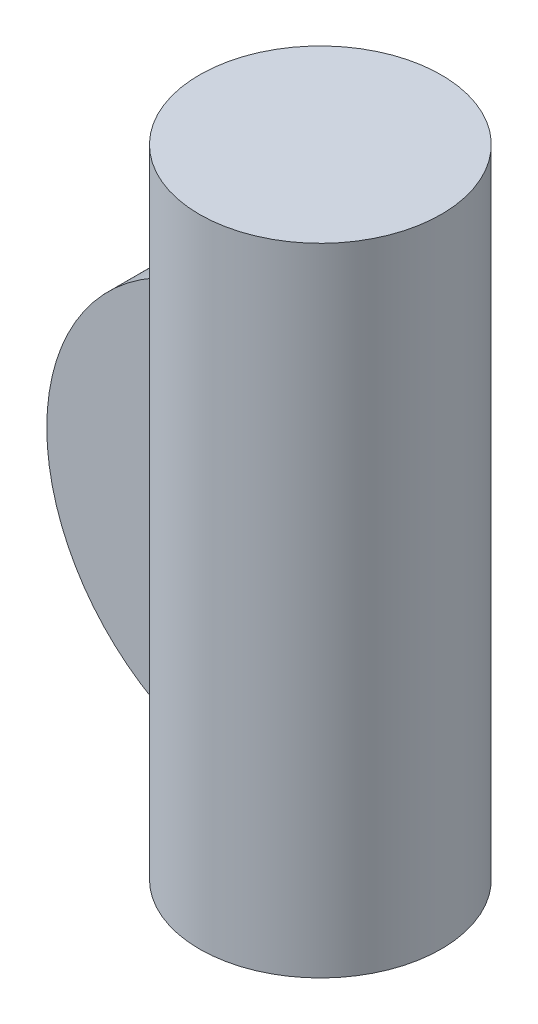
ISO-10303-21;
HEADER;
FILE_DESCRIPTION(('STEP AP214'),'2;1');
FILE_NAME('part.step','',(''),(''),'','','');
FILE_SCHEMA(('AUTOMOTIVE_DESIGN { 1 0 10303 214 1 1 1 1 }'));
ENDSEC;
DATA;
#1=APPLICATION_CONTEXT('core data for automotive mechanical design processes');
#2=APPLICATION_PROTOCOL_DEFINITION('international standard','automotive_design',2000,#1);
#3=PRODUCT_CONTEXT('',#1,'mechanical');
#4=PRODUCT('Part','Part','',(#3));
#5=PRODUCT_RELATED_PRODUCT_CATEGORY('part','',(#4));
#6=PRODUCT_DEFINITION_FORMATION('','',#4);
#7=PRODUCT_DEFINITION_CONTEXT('part definition',#1,'design');
#8=PRODUCT_DEFINITION('design','',#6,#7);
#9=PRODUCT_DEFINITION_SHAPE('','',#8);
#10=(LENGTH_UNIT() NAMED_UNIT(*) SI_UNIT(.MILLI.,.METRE.));
#11=(NAMED_UNIT(*) PLANE_ANGLE_UNIT() SI_UNIT($,.RADIAN.));
#12=(NAMED_UNIT(*) SI_UNIT($,.STERADIAN.) SOLID_ANGLE_UNIT());
#13=UNCERTAINTY_MEASURE_WITH_UNIT(LENGTH_MEASURE(1.E-05),#10,'distance_accuracy_value','');
#14=(GEOMETRIC_REPRESENTATION_CONTEXT(3) GLOBAL_UNCERTAINTY_ASSIGNED_CONTEXT((#13)) GLOBAL_UNIT_ASSIGNED_CONTEXT((#10,
#11,#12)) REPRESENTATION_CONTEXT('',''));
#15=CARTESIAN_POINT('',(0.,0.,0.));
#16=DIRECTION('',(0.,0.,1.));
#17=DIRECTION('',(1.,0.,0.));
#18=AXIS2_PLACEMENT_3D('',#15,#16,#17);
#19=CARTESIAN_POINT('',(0.,12.7,0.));
#20=DIRECTION('',(0.,-1.,0.));
#21=DIRECTION('',(0.,0.,-1.));
#22=AXIS2_PLACEMENT_3D('',#19,#20,#21);
#23=CYLINDRICAL_SURFACE('',#22,2.413);
#24=CARTESIAN_POINT('',(0.,0.,0.));
#25=DIRECTION('',(0.,1.,0.));
#26=DIRECTION('',(0.,0.,1.));
#27=AXIS2_PLACEMENT_3D('',#24,#25,#26);
#28=CIRCLE('',#27,2.413);
#29=CARTESIAN_POINT('',(0.,0.,2.413));
#30=VERTEX_POINT('',#29);
#31=EDGE_CURVE('E102',#30,#30,#28,.T.);
#32=ORIENTED_EDGE('',*,*,#31,.T.);
#33=EDGE_LOOP('',(#32));
#34=FACE_BOUND('',#33,.T.);
#35=CARTESIAN_POINT('',(0.,12.7,0.));
#36=DIRECTION('',(0.,1.,0.));
#37=DIRECTION('',(0.,0.,1.));
#38=AXIS2_PLACEMENT_3D('',#35,#36,#37);
#39=CIRCLE('',#38,2.413);
#40=CARTESIAN_POINT('',(0.,12.7,2.413));
#41=VERTEX_POINT('',#40);
#42=EDGE_CURVE('E66',#41,#41,#39,.T.);
#43=ORIENTED_EDGE('',*,*,#42,.F.);
#44=EDGE_LOOP('',(#43));
#45=FACE_BOUND('',#44,.T.);
#46=DIRECTION('',(0.,-1.,0.));
#47=VECTOR('',#46,1.);
#48=CARTESIAN_POINT('',(-2.05174779151824,12.7,-1.27));
#49=LINE('',#48,#47);
#50=CARTESIAN_POINT('',(-2.05174779151824,10.0044236207643,-1.27));
#51=VERTEX_POINT('',#50);
#52=CARTESIAN_POINT('',(-2.05174779151824,2.69557637923571,-1.27));
#53=VERTEX_POINT('',#52);
#54=EDGE_CURVE('E11',#51,#53,#49,.T.);
#55=ORIENTED_EDGE('',*,*,#54,.F.);
#56=CARTESIAN_POINT('',(0.,10.541,-2.413));
#57=CARTESIAN_POINT('',(-0.124277637249228,10.5409940200185,-2.41299336304963));
#58=CARTESIAN_POINT('',(-0.248758355500067,10.5354113425692,-2.40333297175946));
#59=CARTESIAN_POINT('',(-0.494002380310563,10.5136143992874,-2.36516603636907));
#60=CARTESIAN_POINT('',(-0.614755685070034,10.497373759839,-2.33661273945595));
#61=CARTESIAN_POINT('',(-0.84849211339575,10.4559183213708,-2.26221126559808));
#62=CARTESIAN_POINT('',(-0.961509223811501,10.4307462446565,-2.21644536133677));
#63=CARTESIAN_POINT('',(-1.17795129399248,10.373612624699,-2.10940538553403));
#64=CARTESIAN_POINT('',(-1.28137866647483,10.3416527959062,-2.04813522930966));
#65=CARTESIAN_POINT('',(-1.48423338629655,10.2709555404946,-1.90682899998204));
#66=CARTESIAN_POINT('',(-1.58281960610189,10.2318938890336,-1.82575057314704));
#67=CARTESIAN_POINT('',(-1.76581321737876,10.1521533698034,-1.64943780472773));
#68=CARTESIAN_POINT('',(-1.85020356076299,10.1114726290898,-1.55418669786252));
#69=CARTESIAN_POINT('',(-2.01185971312618,10.0277800285415,-1.33976265924406));
#70=CARTESIAN_POINT('',(-2.08730169113426,9.98500889019922,-1.2191087272989));
#71=CARTESIAN_POINT('',(-2.21651615453764,9.90770101956303,-0.964335378286774));
#72=CARTESIAN_POINT('',(-2.27032181192059,9.87315171532192,-0.830236971227625));
#73=CARTESIAN_POINT('',(-2.34418169051724,9.8243051540268,-0.583160389834326));
#74=CARTESIAN_POINT('',(-2.36909939840019,9.80720354111209,-0.472191619686289));
#75=CARTESIAN_POINT('',(-2.40304368702526,9.78370164835962,-0.246784346127516));
#76=CARTESIAN_POINT('',(-2.41208769441688,9.7772896335322,-0.132349788198802));
#77=CARTESIAN_POINT('',(-2.41378185768347,9.77609690659586,0.096865990521768));
#78=CARTESIAN_POINT('',(-2.40640829735232,9.78133302093031,0.211647473307185));
#79=CARTESIAN_POINT('',(-2.37566187963837,9.80268679310376,0.438030021126774));
#80=CARTESIAN_POINT('',(-2.35227785449406,9.81881204632381,0.549628809504083));
#81=CARTESIAN_POINT('',(-2.29083746132534,9.85968380815242,0.766333326507967));
#82=CARTESIAN_POINT('',(-2.25285639879514,9.88438600652444,0.871469219759344));
#83=CARTESIAN_POINT('',(-2.16355198197181,9.93974629305387,1.07419596879215));
#84=CARTESIAN_POINT('',(-2.112223553229,9.97040664528091,1.17178393662869));
#85=CARTESIAN_POINT('',(-1.98804553494693,10.0402587502311,1.37348348059103));
#86=CARTESIAN_POINT('',(-1.91305416570196,10.0800272358213,1.47607830241487));
#87=CARTESIAN_POINT('',(-1.74804635345664,10.1601496204782,1.66822114510697));
#88=CARTESIAN_POINT('',(-1.65801685218052,10.2005040002517,1.75775769922445));
#89=CARTESIAN_POINT('',(-1.45282681720777,10.2828578770022,1.93184218344593));
#90=CARTESIAN_POINT('',(-1.33595635743975,10.3244935334549,2.01456778903394));
#91=CARTESIAN_POINT('',(-1.08740955700763,10.3995467016589,2.15886888745384));
#92=CARTESIAN_POINT('',(-0.955742459094785,10.4329693025854,2.22045748714923));
#93=CARTESIAN_POINT('',(-0.690573861147793,10.4857690045796,2.31606316964933));
#94=CARTESIAN_POINT('',(-0.557814827883166,10.505950916336,2.35167894441401));
#95=CARTESIAN_POINT('',(-0.286915343507005,10.5333749000779,2.3998162976974));
#96=CARTESIAN_POINT('',(-0.148780506736776,10.5406301204284,2.41236134299281));
#97=CARTESIAN_POINT('',(0.110480615109437,10.5412989577698,2.4135159417579));
#98=CARTESIAN_POINT('',(0.231601331523145,10.5363108314319,2.40488928405349));
#99=CARTESIAN_POINT('',(0.470351993641351,10.5162447972409,2.36978740966585));
#100=CARTESIAN_POINT('',(0.587981896117345,10.5011667644938,2.34331197204842));
#101=CARTESIAN_POINT('',(0.815243367366012,10.462542108815,2.27418048620141));
#102=CARTESIAN_POINT('',(0.924955000754998,10.4391010348016,2.23172575899148));
#103=CARTESIAN_POINT('',(1.13575746981125,10.3856382300467,2.13218763608001));
#104=CARTESIAN_POINT('',(1.23684628368958,10.3556149618402,2.07510082209646));
#105=CARTESIAN_POINT('',(1.43888724822221,10.2878405204102,1.94122473706034));
#106=CARTESIAN_POINT('',(1.5387271493804,10.2496100519732,1.86300214228886));
#107=CARTESIAN_POINT('',(1.72463887696221,10.1710354029841,1.69237663170828));
#108=CARTESIAN_POINT('',(1.81069459977375,10.1306888222147,1.5999573736822));
#109=CARTESIAN_POINT('',(1.97664578442751,10.0468826764234,1.391119100108));
#110=CARTESIAN_POINT('',(2.05470893242076,10.0035953329166,1.27316388896186));
#111=CARTESIAN_POINT('',(2.18974765456304,9.92430285549781,1.02354341292712));
#112=CARTESIAN_POINT('',(2.2467505892016,9.88828830089607,0.891896223187658));
#113=CARTESIAN_POINT('',(2.32732248486878,9.8356640986138,0.647287305484953));
#114=CARTESIAN_POINT('',(2.35543805271512,9.81655013360204,0.536365173091407));
#115=CARTESIAN_POINT('',(2.39569074505154,9.78886072312772,0.31042359747855));
#116=CARTESIAN_POINT('',(2.40784666421774,9.7802728825029,0.195409137852801));
#117=CARTESIAN_POINT('',(2.4155106034754,9.77488201669864,-0.0357196611619962));
#118=CARTESIAN_POINT('',(2.41098122290393,9.77810546684024,-0.151835888877429));
#119=CARTESIAN_POINT('',(2.38547130861108,9.79590115916865,-0.381379951471876));
#120=CARTESIAN_POINT('',(2.36448046464044,9.81048051381953,-0.494806055569871));
#121=CARTESIAN_POINT('',(2.30778588617826,9.8485318164777,-0.713584798834544));
#122=CARTESIAN_POINT('',(2.27240903604877,9.87180531368022,-0.819058760763659));
#123=CARTESIAN_POINT('',(2.18828821460808,9.92468001668123,-1.02280335365467));
#124=CARTESIAN_POINT('',(2.13953938297278,9.95428352238838,-1.12107134896793));
#125=CARTESIAN_POINT('',(2.02137030130052,10.0220374463545,-1.32379882609085));
#126=CARTESIAN_POINT('',(1.949920099365,10.0608017340054,-1.42686979460781));
#127=CARTESIAN_POINT('',(1.79219802627501,10.1394966575978,-1.62055993545985));
#128=CARTESIAN_POINT('',(1.70591294975642,10.179428306161,-1.7111678832798));
#129=CARTESIAN_POINT('',(1.50763234840602,10.262097426136,-1.88934133554991));
#130=CARTESIAN_POINT('',(1.39375186370449,10.3045228996838,-1.974973345334));
#131=CARTESIAN_POINT('',(1.15079430635549,10.3819161599196,-2.12570475084521));
#132=CARTESIAN_POINT('',(1.02172585136317,10.4168881443508,-2.19081571380201));
#133=CARTESIAN_POINT('',(0.775887217839013,10.4701199692136,-2.28797014814794));
#134=CARTESIAN_POINT('',(0.661025029190498,10.4902474887708,-2.32383890813863));
#135=CARTESIAN_POINT('',(0.426193087641429,10.5209426327873,-2.37810038989842));
#136=CARTESIAN_POINT('',(0.306238790322241,10.5315372838142,-2.39654252527444));
#137=CARTESIAN_POINT('',(0.154682634412064,10.5382596582669,-2.40823725755627));
#138=CARTESIAN_POINT('',(0.123787155969279,10.5392856545917,-2.4100214431603));
#139=CARTESIAN_POINT('',(0.0619319944020345,10.5406566123504,-2.41240371408687));
#140=CARTESIAN_POINT('',(0.0309723038745233,10.5410014903229,-2.41300165405175));
#141=CARTESIAN_POINT('',(0.,10.541,-2.413));
#142=B_SPLINE_CURVE_WITH_KNOTS('',3,(#56,#57,#58,#59,#60,#61,#62,#63,#64,#65,#66,#67,#68,#69,
#70,#71,#72,#73,#74,#75,#76,#77,#78,#79,#80,#81,#82,#83,#84,#85,#86,#87,#88,#89,#90,#91,#92,#93,
#94,#95,#96,#97,#98,#99,#100,#101,#102,#103,#104,#105,#106,#107,#108,#109,#110,#111,#112,#113,
#114,#115,#116,#117,#118,#119,#120,#121,#122,#123,#124,#125,#126,#127,#128,#129,#130,#131,#132,
#133,#134,#135,#136,#137,#138,#139,#140,#141),.UNSPECIFIED.,.T.,.F.,(4,2,2,2,2,2,2,2,2,2,2,2,2,
2,2,2,2,2,2,2,2,2,2,2,2,2,2,2,2,2,2,2,2,2,2,2,2,2,2,2,2,2,4),(0.,0.372702340950793,
0.746330446291562,1.11819492640343,1.48996559245235,1.88883581154644,2.28818167339682,
2.73175035215363,3.17463635130993,3.51818170684623,3.86134967098506,4.20501368434449,
4.54891765782012,4.89107075797776,5.23335412979911,5.63125730461678,6.02950780988746,
6.47455270583274,6.91932113277554,7.33364541632614,7.74754802943894,8.1103516312963,
8.47315972405974,8.83154205474068,9.19000818551393,9.58583364168313,9.98211820733879,
10.4237582321418,10.8648224633896,11.2113893076917,11.5575476548123,11.9044823992155,
12.2516346117246,12.5913040631559,12.9310971384643,13.3233800388856,13.7160139578457,
14.1597891361173,14.6033137195541,14.9677898136061,15.3312292981264,15.424102289503,
15.51698666045),.UNSPECIFIED.);
#143=CARTESIAN_POINT('',(-2.05174779151824,10.0044236207643,1.27));
#144=VERTEX_POINT('',#143);
#145=EDGE_CURVE('E42',#51,#144,#142,.T.);
#146=ORIENTED_EDGE('',*,*,#145,.T.);
#147=DIRECTION('',(0.,-1.,0.));
#148=VECTOR('',#147,1.);
#149=CARTESIAN_POINT('',(-2.05174779151824,12.7,1.27));
#150=LINE('',#149,#148);
#151=CARTESIAN_POINT('',(-2.05174779151824,2.69557637923571,1.27));
#152=VERTEX_POINT('',#151);
#153=EDGE_CURVE('E60',#144,#152,#150,.T.);
#154=ORIENTED_EDGE('',*,*,#153,.T.);
#155=CARTESIAN_POINT('',(0.,2.159,-2.413));
#156=CARTESIAN_POINT('',(0.124277637249228,2.15900597998153,-2.41299336304963));
#157=CARTESIAN_POINT('',(0.248758355500067,2.16458865743084,-2.40333297175946));
#158=CARTESIAN_POINT('',(0.494002380310563,2.18638560071258,-2.36516603636907));
#159=CARTESIAN_POINT('',(0.614755685070034,2.20262624016097,-2.33661273945595));
#160=CARTESIAN_POINT('',(0.84849211339575,2.24408167862919,-2.26221126559808));
#161=CARTESIAN_POINT('',(0.961509223811501,2.26925375534349,-2.21644536133677));
#162=CARTESIAN_POINT('',(1.17795129399248,2.32638737530097,-2.10940538553403));
#163=CARTESIAN_POINT('',(1.28137866647483,2.35834720409377,-2.04813522930966));
#164=CARTESIAN_POINT('',(1.48423338629655,2.42904445950536,-1.90682899998204));
#165=CARTESIAN_POINT('',(1.58281960610189,2.46810611096637,-1.82575057314704));
#166=CARTESIAN_POINT('',(1.76581321737876,2.54784663019659,-1.64943780472773));
#167=CARTESIAN_POINT('',(1.85020356076299,2.58852737091023,-1.55418669786252));
#168=CARTESIAN_POINT('',(2.01185971312618,2.67221997145854,-1.33976265924406));
#169=CARTESIAN_POINT('',(2.08730169113426,2.71499110980078,-1.2191087272989));
#170=CARTESIAN_POINT('',(2.21651615453764,2.79229898043697,-0.964335378286774));
#171=CARTESIAN_POINT('',(2.27032181192059,2.82684828467808,-0.830236971227626));
#172=CARTESIAN_POINT('',(2.34418169051724,2.8756948459732,-0.583160389834327));
#173=CARTESIAN_POINT('',(2.36909939840019,2.89279645888791,-0.47219161968629));
#174=CARTESIAN_POINT('',(2.40304368702526,2.91629835164038,-0.246784346127517));
#175=CARTESIAN_POINT('',(2.41208769441688,2.9227103664678,-0.132349788198803));
#176=CARTESIAN_POINT('',(2.41378185768347,2.92390309340414,0.0968659905217672));
#177=CARTESIAN_POINT('',(2.40640829735232,2.91866697906969,0.211647473307184));
#178=CARTESIAN_POINT('',(2.37566187963837,2.89731320689624,0.438030021126773));
#179=CARTESIAN_POINT('',(2.35227785449406,2.88118795367619,0.549628809504083));
#180=CARTESIAN_POINT('',(2.29083746132534,2.84031619184758,0.766333326507965));
#181=CARTESIAN_POINT('',(2.25285639879514,2.81561399347555,0.871469219759342));
#182=CARTESIAN_POINT('',(2.16355198197181,2.76025370694613,1.07419596879215));
#183=CARTESIAN_POINT('',(2.112223553229,2.7295933547191,1.17178393662869));
#184=CARTESIAN_POINT('',(1.98804553494693,2.65974124976889,1.37348348059103));
#185=CARTESIAN_POINT('',(1.91305416570197,2.61997276417874,1.47607830241487));
#186=CARTESIAN_POINT('',(1.74804635345664,2.53985037952179,1.66822114510697));
#187=CARTESIAN_POINT('',(1.65801685218052,2.49949599974833,1.75775769922445));
#188=CARTESIAN_POINT('',(1.45282681720777,2.41714212299783,1.93184218344593));
#189=CARTESIAN_POINT('',(1.33595635743975,2.37550646654513,2.01456778903394));
#190=CARTESIAN_POINT('',(1.08740955700763,2.30045329834112,2.15886888745384));
#191=CARTESIAN_POINT('',(0.955742459094786,2.26703069741456,2.22045748714923));
#192=CARTESIAN_POINT('',(0.690573861147793,2.2142309954204,2.31606316964933));
#193=CARTESIAN_POINT('',(0.557814827883167,2.19404908366403,2.35167894441401));
#194=CARTESIAN_POINT('',(0.286915343507006,2.16662509992212,2.3998162976974));
#195=CARTESIAN_POINT('',(0.148780506736777,2.15936987957162,2.41236134299281));
#196=CARTESIAN_POINT('',(-0.110480615109437,2.15870104223019,2.4135159417579));
#197=CARTESIAN_POINT('',(-0.231601331523146,2.16368916856809,2.40488928405349));
#198=CARTESIAN_POINT('',(-0.470351993641352,2.1837552027591,2.36978740966585));
#199=CARTESIAN_POINT('',(-0.587981896117346,2.19883323550618,2.34331197204842));
#200=CARTESIAN_POINT('',(-0.815243367366012,2.23745789118503,2.27418048620141));
#201=CARTESIAN_POINT('',(-0.924955000754998,2.26089896519844,2.23172575899148));
#202=CARTESIAN_POINT('',(-1.13575746981125,2.31436176995329,2.13218763608001));
#203=CARTESIAN_POINT('',(-1.23684628368958,2.34438503815982,2.07510082209646));
#204=CARTESIAN_POINT('',(-1.43888724822221,2.41215947958978,1.94122473706034));
#205=CARTESIAN_POINT('',(-1.5387271493804,2.45038994802678,1.86300214228886));
#206=CARTESIAN_POINT('',(-1.72463887696221,2.52896459701589,1.69237663170828));
#207=CARTESIAN_POINT('',(-1.81069459977375,2.56931117778535,1.5999573736822));
#208=CARTESIAN_POINT('',(-1.97664578442751,2.65311732357656,1.391119100108));
#209=CARTESIAN_POINT('',(-2.05470893242076,2.69640466708336,1.27316388896186));
#210=CARTESIAN_POINT('',(-2.18974765456304,2.77569714450219,1.02354341292712));
#211=CARTESIAN_POINT('',(-2.2467505892016,2.81171169910393,0.891896223187658));
#212=CARTESIAN_POINT('',(-2.32732248486878,2.8643359013862,0.647287305484953));
#213=CARTESIAN_POINT('',(-2.35543805271512,2.88344986639796,0.536365173091407));
#214=CARTESIAN_POINT('',(-2.39569074505154,2.91113927687228,0.310423597478549));
#215=CARTESIAN_POINT('',(-2.40784666421774,2.9197271174971,0.195409137852801));
#216=CARTESIAN_POINT('',(-2.4155106034754,2.92511798330136,-0.0357196611619966));
#217=CARTESIAN_POINT('',(-2.41098122290393,2.92189453315976,-0.15183588887743));
#218=CARTESIAN_POINT('',(-2.38547130861108,2.90409884083136,-0.381379951471877));
#219=CARTESIAN_POINT('',(-2.36448046464044,2.88951948618047,-0.494806055569871));
#220=CARTESIAN_POINT('',(-2.30778588617826,2.8514681835223,-0.713584798834544));
#221=CARTESIAN_POINT('',(-2.27240903604877,2.82819468631978,-0.819058760763659));
#222=CARTESIAN_POINT('',(-2.18828821460808,2.77531998331877,-1.02280335365467));
#223=CARTESIAN_POINT('',(-2.13953938297278,2.74571647761162,-1.12107134896793));
#224=CARTESIAN_POINT('',(-2.02137030130052,2.67796255364552,-1.32379882609086));
#225=CARTESIAN_POINT('',(-1.949920099365,2.63919826599463,-1.42686979460781));
#226=CARTESIAN_POINT('',(-1.79219802627501,2.56050334240224,-1.62055993545985));
#227=CARTESIAN_POINT('',(-1.70591294975642,2.52057169383896,-1.7111678832798));
#228=CARTESIAN_POINT('',(-1.50763234840602,2.43790257386404,-1.88934133554991));
#229=CARTESIAN_POINT('',(-1.39375186370449,2.39547710031616,-1.974973345334));
#230=CARTESIAN_POINT('',(-1.15079430635549,2.31808384008038,-2.12570475084521));
#231=CARTESIAN_POINT('',(-1.02172585136317,2.28311185564924,-2.19081571380201));
#232=CARTESIAN_POINT('',(-0.775887217839012,2.22988003078642,-2.28797014814794));
#233=CARTESIAN_POINT('',(-0.661025029190498,2.20975251122917,-2.32383890813863));
#234=CARTESIAN_POINT('',(-0.426193087641429,2.1790573672127,-2.37810038989842));
#235=CARTESIAN_POINT('',(-0.30623879032224,2.16846271618579,-2.39654252527444));
#236=CARTESIAN_POINT('',(-0.154682634412063,2.16174034173309,-2.40823725755627));
#237=CARTESIAN_POINT('',(-0.123787155969279,2.16071434540831,-2.4100214431603));
#238=CARTESIAN_POINT('',(-0.0619319944020343,2.1593433876496,-2.41240371408687));
#239=CARTESIAN_POINT('',(-0.0309723038745232,2.15899850967713,-2.41300165405175));
#240=CARTESIAN_POINT('',(0.,2.159,-2.413));
#241=B_SPLINE_CURVE_WITH_KNOTS('',3,(#155,#156,#157,#158,#159,#160,#161,#162,#163,#164,#165,
#166,#167,#168,#169,#170,#171,#172,#173,#174,#175,#176,#177,#178,#179,#180,#181,#182,#183,#184,
#185,#186,#187,#188,#189,#190,#191,#192,#193,#194,#195,#196,#197,#198,#199,#200,#201,#202,#203,
#204,#205,#206,#207,#208,#209,#210,#211,#212,#213,#214,#215,#216,#217,#218,#219,#220,#221,#222,
#223,#224,#225,#226,#227,#228,#229,#230,#231,#232,#233,#234,#235,#236,#237,#238,#239,#240),
.UNSPECIFIED.,.T.,.F.,(4,2,2,2,2,2,2,2,2,2,2,2,2,2,2,2,2,2,2,2,2,2,2,2,2,2,2,2,2,2,2,2,2,2,2,2,
2,2,2,2,2,2,4),(0.,0.372702340950793,0.746330446291562,1.11819492640343,1.48996559245235,
1.88883581154644,2.28818167339682,2.73175035215363,3.17463635130992,3.51818170684622,
3.86134967098506,4.20501368434449,4.54891765782012,4.89107075797776,5.23335412979911,
5.63125730461678,6.02950780988746,6.47455270583273,6.91932113277554,7.33364541632614,
7.74754802943894,8.1103516312963,8.47315972405974,8.83154205474068,9.19000818551393,
9.58583364168313,9.98211820733879,10.4237582321418,10.8648224633896,11.2113893076917,
11.5575476548123,11.9044823992155,12.2516346117246,12.5913040631559,12.9310971384643,
13.3233800388856,13.7160139578457,14.1597891361173,14.6033137195541,14.9677898136061,
15.3312292981264,15.424102289503,15.51698666045),.UNSPECIFIED.);
#242=EDGE_CURVE('E65',#152,#53,#241,.T.);
#243=ORIENTED_EDGE('',*,*,#242,.T.);
#244=EDGE_LOOP('',(#55,#146,#154,#243));
#245=FACE_BOUND('',#244,.T.);
#246=ADVANCED_FACE('F34',(#34,#45,#245),#23,.T.);
#247=CARTESIAN_POINT('',(0.,12.7,0.));
#248=DIRECTION('',(0.,1.,0.));
#249=DIRECTION('',(0.,0.,1.));
#250=AXIS2_PLACEMENT_3D('',#247,#248,#249);
#251=PLANE('',#250);
#252=ORIENTED_EDGE('',*,*,#42,.T.);
#253=EDGE_LOOP('',(#252));
#254=FACE_BOUND('',#253,.T.);
#255=ADVANCED_FACE('F87',(#254),#251,.T.);
#256=CARTESIAN_POINT('',(0.,0.,0.));
#257=DIRECTION('',(0.,1.,0.));
#258=DIRECTION('',(0.,0.,1.));
#259=AXIS2_PLACEMENT_3D('',#256,#257,#258);
#260=PLANE('',#259);
#261=ORIENTED_EDGE('',*,*,#31,.F.);
#262=EDGE_LOOP('',(#261));
#263=FACE_BOUND('',#262,.T.);
#264=ADVANCED_FACE('F85',(#263),#260,.F.);
#265=CARTESIAN_POINT('',(0.,6.35,-1.27));
#266=DIRECTION('',(0.,0.,1.));
#267=DIRECTION('',(1.,0.,0.));
#268=AXIS2_PLACEMENT_3D('',#265,#266,#267);
#269=CYLINDRICAL_SURFACE('',#268,4.191);
#270=ORIENTED_EDGE('',*,*,#145,.F.);
#271=CARTESIAN_POINT('',(0.,6.35,-1.27));
#272=DIRECTION('',(0.,0.,1.));
#273=DIRECTION('',(1.,0.,0.));
#274=AXIS2_PLACEMENT_3D('',#271,#272,#273);
#275=CIRCLE('',#274,4.191);
#276=EDGE_CURVE('E70',#51,#53,#275,.T.);
#277=ORIENTED_EDGE('',*,*,#276,.T.);
#278=ORIENTED_EDGE('',*,*,#242,.F.);
#279=CARTESIAN_POINT('',(0.,6.35,1.27));
#280=DIRECTION('',(0.,0.,1.));
#281=DIRECTION('',(1.,0.,0.));
#282=AXIS2_PLACEMENT_3D('',#279,#280,#281);
#283=CIRCLE('',#282,4.191);
#284=EDGE_CURVE('E48',#144,#152,#283,.T.);
#285=ORIENTED_EDGE('',*,*,#284,.F.);
#286=EDGE_LOOP('',(#270,#277,#278,#285));
#287=FACE_BOUND('',#286,.T.);
#288=ADVANCED_FACE('F69',(#287),#269,.T.);
#289=CARTESIAN_POINT('',(0.,0.,-1.27));
#290=DIRECTION('',(0.,0.,1.));
#291=DIRECTION('',(1.,0.,0.));
#292=AXIS2_PLACEMENT_3D('',#289,#290,#291);
#293=PLANE('',#292);
#294=ORIENTED_EDGE('',*,*,#276,.F.);
#295=ORIENTED_EDGE('',*,*,#54,.T.);
#296=EDGE_LOOP('',(#294,#295));
#297=FACE_BOUND('',#296,.T.);
#298=ADVANCED_FACE('F84',(#297),#293,.F.);
#299=CARTESIAN_POINT('',(0.,0.,1.27));
#300=DIRECTION('',(0.,0.,1.));
#301=DIRECTION('',(1.,0.,0.));
#302=AXIS2_PLACEMENT_3D('',#299,#300,#301);
#303=PLANE('',#302);
#304=ORIENTED_EDGE('',*,*,#153,.F.);
#305=ORIENTED_EDGE('',*,*,#284,.T.);
#306=EDGE_LOOP('',(#304,#305));
#307=FACE_BOUND('',#306,.T.);
#308=ADVANCED_FACE('F61',(#307),#303,.T.);
#309=CLOSED_SHELL('',(#246,#255,#264,#288,#298,#308));
#310=MANIFOLD_SOLID_BREP('B2',#309);
#311=ADVANCED_BREP_SHAPE_REPRESENTATION('',(#18,#310),#14);
#312=SHAPE_DEFINITION_REPRESENTATION(#9,#311);
ENDSEC;
END-ISO-10303-21;
